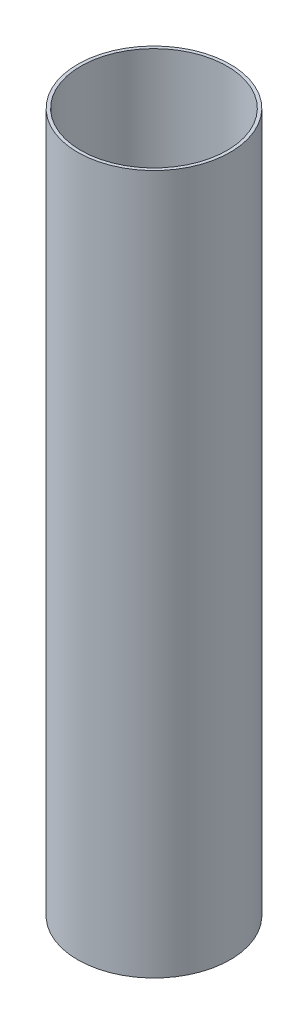
ISO-10303-21;
HEADER;
FILE_DESCRIPTION(('STEP AP214'),'2;1');
FILE_NAME('part.step','',(''),(''),'','','');
FILE_SCHEMA(('AUTOMOTIVE_DESIGN { 1 0 10303 214 1 1 1 1 }'));
ENDSEC;
DATA;
#1=APPLICATION_CONTEXT('core data for automotive mechanical design processes');
#2=APPLICATION_PROTOCOL_DEFINITION('international standard','automotive_design',2000,#1);
#3=PRODUCT_CONTEXT('',#1,'mechanical');
#4=PRODUCT('Part','Part','',(#3));
#5=PRODUCT_RELATED_PRODUCT_CATEGORY('part','',(#4));
#6=PRODUCT_DEFINITION_FORMATION('','',#4);
#7=PRODUCT_DEFINITION_CONTEXT('part definition',#1,'design');
#8=PRODUCT_DEFINITION('design','',#6,#7);
#9=PRODUCT_DEFINITION_SHAPE('','',#8);
#10=(LENGTH_UNIT() NAMED_UNIT(*) SI_UNIT(.MILLI.,.METRE.));
#11=(NAMED_UNIT(*) PLANE_ANGLE_UNIT() SI_UNIT($,.RADIAN.));
#12=(NAMED_UNIT(*) SI_UNIT($,.STERADIAN.) SOLID_ANGLE_UNIT());
#13=UNCERTAINTY_MEASURE_WITH_UNIT(LENGTH_MEASURE(1.E-05),#10,'distance_accuracy_value','');
#14=(GEOMETRIC_REPRESENTATION_CONTEXT(3) GLOBAL_UNCERTAINTY_ASSIGNED_CONTEXT((#13)) GLOBAL_UNIT_ASSIGNED_CONTEXT((#10,
#11,#12)) REPRESENTATION_CONTEXT('',''));
#15=CARTESIAN_POINT('',(0.,0.,0.));
#16=DIRECTION('',(0.,0.,1.));
#17=DIRECTION('',(1.,0.,0.));
#18=AXIS2_PLACEMENT_3D('',#15,#16,#17);
#19=CARTESIAN_POINT('',(0.,220.,0.));
#20=DIRECTION('',(0.,1.,0.));
#21=DIRECTION('',(0.,0.,1.));
#22=AXIS2_PLACEMENT_3D('',#19,#20,#21);
#23=PLANE('',#22);
#24=CARTESIAN_POINT('',(0.,220.,0.));
#25=DIRECTION('',(0.,1.,0.));
#26=DIRECTION('',(0.,0.,1.));
#27=AXIS2_PLACEMENT_3D('',#24,#25,#26);
#28=CIRCLE('',#27,24.);
#29=CARTESIAN_POINT('',(0.,220.,24.));
#30=VERTEX_POINT('',#29);
#31=EDGE_CURVE('E10',#30,#30,#28,.T.);
#32=ORIENTED_EDGE('',*,*,#31,.T.);
#33=EDGE_LOOP('',(#32));
#34=FACE_BOUND('',#33,.T.);
#35=CARTESIAN_POINT('',(0.,220.,0.));
#36=DIRECTION('',(0.,1.,0.));
#37=DIRECTION('',(0.,0.,1.));
#38=AXIS2_PLACEMENT_3D('',#35,#36,#37);
#39=CIRCLE('',#38,23.);
#40=CARTESIAN_POINT('',(0.,220.,23.));
#41=VERTEX_POINT('',#40);
#42=EDGE_CURVE('E42',#41,#41,#39,.T.);
#43=ORIENTED_EDGE('',*,*,#42,.F.);
#44=EDGE_LOOP('',(#43));
#45=FACE_BOUND('',#44,.T.);
#46=ADVANCED_FACE('F31',(#34,#45),#23,.T.);
#47=CARTESIAN_POINT('',(0.,0.,0.));
#48=DIRECTION('',(0.,1.,0.));
#49=DIRECTION('',(0.,0.,1.));
#50=AXIS2_PLACEMENT_3D('',#47,#48,#49);
#51=PLANE('',#50);
#52=CARTESIAN_POINT('',(0.,0.,0.));
#53=DIRECTION('',(0.,1.,0.));
#54=DIRECTION('',(0.,0.,1.));
#55=AXIS2_PLACEMENT_3D('',#52,#53,#54);
#56=CIRCLE('',#55,24.);
#57=CARTESIAN_POINT('',(0.,0.,24.));
#58=VERTEX_POINT('',#57);
#59=EDGE_CURVE('E35',#58,#58,#56,.T.);
#60=ORIENTED_EDGE('',*,*,#59,.F.);
#61=EDGE_LOOP('',(#60));
#62=FACE_BOUND('',#61,.T.);
#63=CARTESIAN_POINT('',(0.,0.,0.));
#64=DIRECTION('',(0.,1.,0.));
#65=DIRECTION('',(0.,0.,1.));
#66=AXIS2_PLACEMENT_3D('',#63,#64,#65);
#67=CIRCLE('',#66,23.);
#68=CARTESIAN_POINT('',(0.,0.,23.));
#69=VERTEX_POINT('',#68);
#70=EDGE_CURVE('E44',#69,#69,#67,.T.);
#71=ORIENTED_EDGE('',*,*,#70,.T.);
#72=EDGE_LOOP('',(#71));
#73=FACE_BOUND('',#72,.T.);
#74=ADVANCED_FACE('F54',(#62,#73),#51,.F.);
#75=CARTESIAN_POINT('',(0.,220.,0.));
#76=DIRECTION('',(0.,-1.,0.));
#77=DIRECTION('',(0.,0.,-1.));
#78=AXIS2_PLACEMENT_3D('',#75,#76,#77);
#79=CYLINDRICAL_SURFACE('',#78,24.);
#80=ORIENTED_EDGE('',*,*,#31,.F.);
#81=EDGE_LOOP('',(#80));
#82=FACE_BOUND('',#81,.T.);
#83=ORIENTED_EDGE('',*,*,#59,.T.);
#84=EDGE_LOOP('',(#83));
#85=FACE_BOUND('',#84,.T.);
#86=ADVANCED_FACE('F33',(#82,#85),#79,.T.);
#87=CARTESIAN_POINT('',(0.,220.,0.));
#88=DIRECTION('',(0.,-1.,0.));
#89=DIRECTION('',(0.,0.,-1.));
#90=AXIS2_PLACEMENT_3D('',#87,#88,#89);
#91=CYLINDRICAL_SURFACE('',#90,23.);
#92=ORIENTED_EDGE('',*,*,#42,.T.);
#93=EDGE_LOOP('',(#92));
#94=FACE_BOUND('',#93,.T.);
#95=ORIENTED_EDGE('',*,*,#70,.F.);
#96=EDGE_LOOP('',(#95));
#97=FACE_BOUND('',#96,.T.);
#98=ADVANCED_FACE('F50',(#94,#97),#91,.F.);
#99=CLOSED_SHELL('',(#46,#74,#86,#98));
#100=MANIFOLD_SOLID_BREP('B2',#99);
#101=ADVANCED_BREP_SHAPE_REPRESENTATION('',(#18,#100),#14);
#102=SHAPE_DEFINITION_REPRESENTATION(#9,#101);
ENDSEC;
END-ISO-10303-21;
